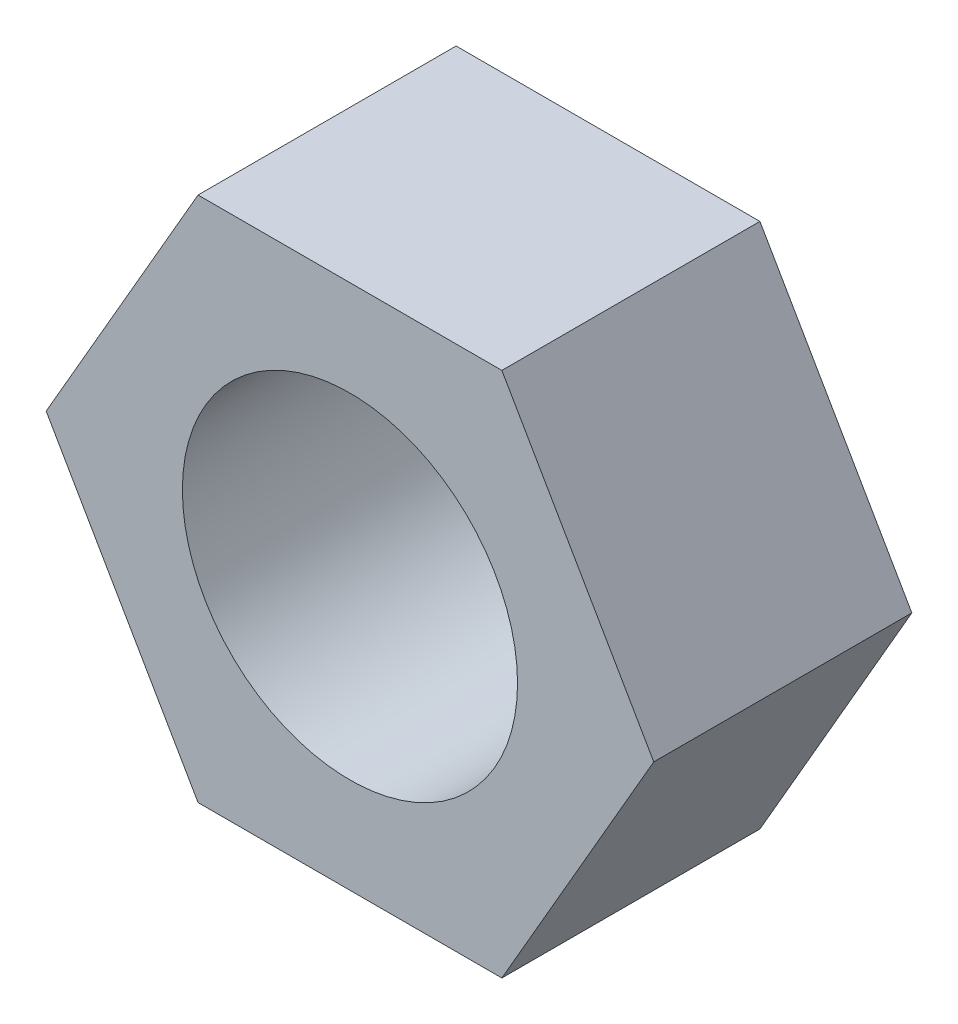
ISO-10303-21;
HEADER;
FILE_DESCRIPTION(('STEP AP214'),'2;1');
FILE_NAME('part.step','',(''),(''),'','','');
FILE_SCHEMA(('AUTOMOTIVE_DESIGN { 1 0 10303 214 1 1 1 1 }'));
ENDSEC;
DATA;
#1=APPLICATION_CONTEXT('core data for automotive mechanical design processes');
#2=APPLICATION_PROTOCOL_DEFINITION('international standard','automotive_design',2000,#1);
#3=PRODUCT_CONTEXT('',#1,'mechanical');
#4=PRODUCT('Part','Part','',(#3));
#5=PRODUCT_RELATED_PRODUCT_CATEGORY('part','',(#4));
#6=PRODUCT_DEFINITION_FORMATION('','',#4);
#7=PRODUCT_DEFINITION_CONTEXT('part definition',#1,'design');
#8=PRODUCT_DEFINITION('design','',#6,#7);
#9=PRODUCT_DEFINITION_SHAPE('','',#8);
#10=(LENGTH_UNIT() NAMED_UNIT(*) SI_UNIT(.MILLI.,.METRE.));
#11=(NAMED_UNIT(*) PLANE_ANGLE_UNIT() SI_UNIT($,.RADIAN.));
#12=(NAMED_UNIT(*) SI_UNIT($,.STERADIAN.) SOLID_ANGLE_UNIT());
#13=UNCERTAINTY_MEASURE_WITH_UNIT(LENGTH_MEASURE(1.E-05),#10,'distance_accuracy_value','');
#14=(GEOMETRIC_REPRESENTATION_CONTEXT(3) GLOBAL_UNCERTAINTY_ASSIGNED_CONTEXT((#13)) GLOBAL_UNIT_ASSIGNED_CONTEXT((#10,
#11,#12)) REPRESENTATION_CONTEXT('',''));
#15=CARTESIAN_POINT('',(0.,0.,0.));
#16=DIRECTION('',(0.,0.,1.));
#17=DIRECTION('',(1.,0.,0.));
#18=AXIS2_PLACEMENT_3D('',#15,#16,#17);
#19=CARTESIAN_POINT('',(0.,0.,3.85));
#20=DIRECTION('',(0.,0.,1.));
#21=DIRECTION('',(1.,0.,0.));
#22=AXIS2_PLACEMENT_3D('',#19,#20,#21);
#23=PLANE('',#22);
#24=DIRECTION('',(0.5,0.866025403784439,0.));
#25=VECTOR('',#24,1.);
#26=CARTESIAN_POINT('',(2.26609980656928,-3.925,3.85));
#27=LINE('',#26,#25);
#28=CARTESIAN_POINT('',(2.26609980656928,-3.925,3.85));
#29=VERTEX_POINT('',#28);
#30=CARTESIAN_POINT('',(4.53219961313856,0.,3.85));
#31=VERTEX_POINT('',#30);
#32=EDGE_CURVE('E144',#29,#31,#27,.T.);
#33=ORIENTED_EDGE('',*,*,#32,.T.);
#34=DIRECTION('',(-0.5,0.866025403784438,0.));
#35=VECTOR('',#34,1.);
#36=CARTESIAN_POINT('',(4.53219961313856,0.,3.85));
#37=LINE('',#36,#35);
#38=CARTESIAN_POINT('',(2.26609980656928,3.925,3.85));
#39=VERTEX_POINT('',#38);
#40=EDGE_CURVE('E91',#31,#39,#37,.T.);
#41=ORIENTED_EDGE('',*,*,#40,.T.);
#42=DIRECTION('',(-1.,0.,0.));
#43=VECTOR('',#42,1.);
#44=CARTESIAN_POINT('',(2.26609980656928,3.925,3.85));
#45=LINE('',#44,#43);
#46=CARTESIAN_POINT('',(-2.26609980656928,3.925,3.85));
#47=VERTEX_POINT('',#46);
#48=EDGE_CURVE('E104',#39,#47,#45,.T.);
#49=ORIENTED_EDGE('',*,*,#48,.T.);
#50=DIRECTION('',(-0.5,-0.866025403784438,0.));
#51=VECTOR('',#50,1.);
#52=CARTESIAN_POINT('',(-2.26609980656928,3.925,3.85));
#53=LINE('',#52,#51);
#54=CARTESIAN_POINT('',(-4.53219961313856,0.,3.85));
#55=VERTEX_POINT('',#54);
#56=EDGE_CURVE('E98',#47,#55,#53,.T.);
#57=ORIENTED_EDGE('',*,*,#56,.T.);
#58=DIRECTION('',(0.5,-0.866025403784439,0.));
#59=VECTOR('',#58,1.);
#60=CARTESIAN_POINT('',(-4.53219961313856,0.,3.85));
#61=LINE('',#60,#59);
#62=CARTESIAN_POINT('',(-2.26609980656928,-3.925,3.85));
#63=VERTEX_POINT('',#62);
#64=EDGE_CURVE('E102',#55,#63,#61,.T.);
#65=ORIENTED_EDGE('',*,*,#64,.T.);
#66=DIRECTION('',(1.,0.,0.));
#67=VECTOR('',#66,1.);
#68=CARTESIAN_POINT('',(-2.26609980656928,-3.925,3.85));
#69=LINE('',#68,#67);
#70=EDGE_CURVE('E54',#63,#29,#69,.T.);
#71=ORIENTED_EDGE('',*,*,#70,.T.);
#72=EDGE_LOOP('',(#33,#41,#49,#57,#65,#71));
#73=FACE_BOUND('',#72,.T.);
#74=CARTESIAN_POINT('',(0.,0.,3.85));
#75=DIRECTION('',(0.,0.,1.));
#76=DIRECTION('',(1.,0.,0.));
#77=AXIS2_PLACEMENT_3D('',#74,#75,#76);
#78=CIRCLE('',#77,2.5);
#79=CARTESIAN_POINT('',(2.5,0.,3.85));
#80=VERTEX_POINT('',#79);
#81=EDGE_CURVE('E133',#80,#80,#78,.T.);
#82=ORIENTED_EDGE('',*,*,#81,.F.);
#83=EDGE_LOOP('',(#82));
#84=FACE_BOUND('',#83,.T.);
#85=ADVANCED_FACE('F36',(#73,#84),#23,.T.);
#86=CARTESIAN_POINT('',(0.,0.,0.));
#87=DIRECTION('',(0.,0.,1.));
#88=DIRECTION('',(1.,0.,0.));
#89=AXIS2_PLACEMENT_3D('',#86,#87,#88);
#90=PLANE('',#89);
#91=DIRECTION('',(0.5,0.866025403784439,0.));
#92=VECTOR('',#91,1.);
#93=CARTESIAN_POINT('',(2.26609980656928,-3.925,0.));
#94=LINE('',#93,#92);
#95=CARTESIAN_POINT('',(2.26609980656928,-3.925,0.));
#96=VERTEX_POINT('',#95);
#97=CARTESIAN_POINT('',(4.53219961313856,0.,0.));
#98=VERTEX_POINT('',#97);
#99=EDGE_CURVE('E128',#96,#98,#94,.T.);
#100=ORIENTED_EDGE('',*,*,#99,.F.);
#101=DIRECTION('',(1.,0.,0.));
#102=VECTOR('',#101,1.);
#103=CARTESIAN_POINT('',(-2.26609980656928,-3.925,0.));
#104=LINE('',#103,#102);
#105=CARTESIAN_POINT('',(-2.26609980656928,-3.925,0.));
#106=VERTEX_POINT('',#105);
#107=EDGE_CURVE('E83',#106,#96,#104,.T.);
#108=ORIENTED_EDGE('',*,*,#107,.F.);
#109=DIRECTION('',(0.5,-0.866025403784439,0.));
#110=VECTOR('',#109,1.);
#111=CARTESIAN_POINT('',(-4.53219961313856,0.,0.));
#112=LINE('',#111,#110);
#113=CARTESIAN_POINT('',(-4.53219961313856,0.,0.));
#114=VERTEX_POINT('',#113);
#115=EDGE_CURVE('E77',#114,#106,#112,.T.);
#116=ORIENTED_EDGE('',*,*,#115,.F.);
#117=DIRECTION('',(-0.5,-0.866025403784438,0.));
#118=VECTOR('',#117,1.);
#119=CARTESIAN_POINT('',(-2.26609980656928,3.925,0.));
#120=LINE('',#119,#118);
#121=CARTESIAN_POINT('',(-2.26609980656928,3.925,0.));
#122=VERTEX_POINT('',#121);
#123=EDGE_CURVE('E113',#122,#114,#120,.T.);
#124=ORIENTED_EDGE('',*,*,#123,.F.);
#125=DIRECTION('',(-1.,0.,0.));
#126=VECTOR('',#125,1.);
#127=CARTESIAN_POINT('',(2.26609980656928,3.925,0.));
#128=LINE('',#127,#126);
#129=CARTESIAN_POINT('',(2.26609980656928,3.925,0.));
#130=VERTEX_POINT('',#129);
#131=EDGE_CURVE('E136',#130,#122,#128,.T.);
#132=ORIENTED_EDGE('',*,*,#131,.F.);
#133=DIRECTION('',(-0.5,0.866025403784438,0.));
#134=VECTOR('',#133,1.);
#135=CARTESIAN_POINT('',(4.53219961313856,0.,0.));
#136=LINE('',#135,#134);
#137=EDGE_CURVE('E132',#98,#130,#136,.T.);
#138=ORIENTED_EDGE('',*,*,#137,.F.);
#139=EDGE_LOOP('',(#100,#108,#116,#124,#132,#138));
#140=FACE_BOUND('',#139,.T.);
#141=CARTESIAN_POINT('',(0.,0.,0.));
#142=DIRECTION('',(0.,0.,1.));
#143=DIRECTION('',(1.,0.,0.));
#144=AXIS2_PLACEMENT_3D('',#141,#142,#143);
#145=CIRCLE('',#144,2.5);
#146=CARTESIAN_POINT('',(2.5,0.,0.));
#147=VERTEX_POINT('',#146);
#148=EDGE_CURVE('E249',#147,#147,#145,.T.);
#149=ORIENTED_EDGE('',*,*,#148,.T.);
#150=EDGE_LOOP('',(#149));
#151=FACE_BOUND('',#150,.T.);
#152=ADVANCED_FACE('F156',(#140,#151),#90,.F.);
#153=CARTESIAN_POINT('',(2.26609980656928,-3.925,3.85));
#154=DIRECTION('',(-0.866025403784439,0.5,0.));
#155=DIRECTION('',(-0.5,-0.866025403784439,0.));
#156=AXIS2_PLACEMENT_3D('',#153,#154,#155);
#157=PLANE('',#156);
#158=ORIENTED_EDGE('',*,*,#99,.T.);
#159=DIRECTION('',(0.,0.,-1.));
#160=VECTOR('',#159,1.);
#161=CARTESIAN_POINT('',(4.53219961313856,0.,3.85));
#162=LINE('',#161,#160);
#163=EDGE_CURVE('E11',#31,#98,#162,.T.);
#164=ORIENTED_EDGE('',*,*,#163,.F.);
#165=ORIENTED_EDGE('',*,*,#32,.F.);
#166=DIRECTION('',(0.,0.,-1.));
#167=VECTOR('',#166,1.);
#168=CARTESIAN_POINT('',(2.26609980656928,-3.925,3.85));
#169=LINE('',#168,#167);
#170=EDGE_CURVE('E124',#29,#96,#169,.T.);
#171=ORIENTED_EDGE('',*,*,#170,.T.);
#172=EDGE_LOOP('',(#158,#164,#165,#171));
#173=FACE_BOUND('',#172,.T.);
#174=ADVANCED_FACE('F38',(#173),#157,.F.);
#175=CARTESIAN_POINT('',(4.53219961313856,0.,3.85));
#176=DIRECTION('',(-0.866025403784439,-0.5,0.));
#177=DIRECTION('',(0.5,-0.866025403784439,0.));
#178=AXIS2_PLACEMENT_3D('',#175,#176,#177);
#179=PLANE('',#178);
#180=ORIENTED_EDGE('',*,*,#137,.T.);
#181=DIRECTION('',(0.,0.,-1.));
#182=VECTOR('',#181,1.);
#183=CARTESIAN_POINT('',(2.26609980656928,3.925,3.85));
#184=LINE('',#183,#182);
#185=EDGE_CURVE('E46',#39,#130,#184,.T.);
#186=ORIENTED_EDGE('',*,*,#185,.F.);
#187=ORIENTED_EDGE('',*,*,#40,.F.);
#188=ORIENTED_EDGE('',*,*,#163,.T.);
#189=EDGE_LOOP('',(#180,#186,#187,#188));
#190=FACE_BOUND('',#189,.T.);
#191=ADVANCED_FACE('F181',(#190),#179,.F.);
#192=CARTESIAN_POINT('',(2.26609980656928,3.925,3.85));
#193=DIRECTION('',(0.,-1.,0.));
#194=DIRECTION('',(1.,0.,0.));
#195=AXIS2_PLACEMENT_3D('',#192,#193,#194);
#196=PLANE('',#195);
#197=ORIENTED_EDGE('',*,*,#131,.T.);
#198=DIRECTION('',(0.,0.,-1.));
#199=VECTOR('',#198,1.);
#200=CARTESIAN_POINT('',(-2.26609980656928,3.925,3.85));
#201=LINE('',#200,#199);
#202=EDGE_CURVE('E115',#47,#122,#201,.T.);
#203=ORIENTED_EDGE('',*,*,#202,.F.);
#204=ORIENTED_EDGE('',*,*,#48,.F.);
#205=ORIENTED_EDGE('',*,*,#185,.T.);
#206=EDGE_LOOP('',(#197,#203,#204,#205));
#207=FACE_BOUND('',#206,.T.);
#208=ADVANCED_FACE('F153',(#207),#196,.F.);
#209=CARTESIAN_POINT('',(-2.26609980656928,3.925,3.85));
#210=DIRECTION('',(0.866025403784439,-0.5,0.));
#211=DIRECTION('',(0.5,0.866025403784439,0.));
#212=AXIS2_PLACEMENT_3D('',#209,#210,#211);
#213=PLANE('',#212);
#214=ORIENTED_EDGE('',*,*,#123,.T.);
#215=DIRECTION('',(0.,0.,-1.));
#216=VECTOR('',#215,1.);
#217=CARTESIAN_POINT('',(-4.53219961313856,0.,3.85));
#218=LINE('',#217,#216);
#219=EDGE_CURVE('E110',#55,#114,#218,.T.);
#220=ORIENTED_EDGE('',*,*,#219,.F.);
#221=ORIENTED_EDGE('',*,*,#56,.F.);
#222=ORIENTED_EDGE('',*,*,#202,.T.);
#223=EDGE_LOOP('',(#214,#220,#221,#222));
#224=FACE_BOUND('',#223,.T.);
#225=ADVANCED_FACE('F111',(#224),#213,.F.);
#226=CARTESIAN_POINT('',(-4.53219961313856,0.,3.85));
#227=DIRECTION('',(0.866025403784439,0.5,0.));
#228=DIRECTION('',(-0.5,0.866025403784439,0.));
#229=AXIS2_PLACEMENT_3D('',#226,#227,#228);
#230=PLANE('',#229);
#231=ORIENTED_EDGE('',*,*,#115,.T.);
#232=DIRECTION('',(0.,0.,-1.));
#233=VECTOR('',#232,1.);
#234=CARTESIAN_POINT('',(-2.26609980656928,-3.925,3.85));
#235=LINE('',#234,#233);
#236=EDGE_CURVE('E116',#63,#106,#235,.T.);
#237=ORIENTED_EDGE('',*,*,#236,.F.);
#238=ORIENTED_EDGE('',*,*,#64,.F.);
#239=ORIENTED_EDGE('',*,*,#219,.T.);
#240=EDGE_LOOP('',(#231,#237,#238,#239));
#241=FACE_BOUND('',#240,.T.);
#242=ADVANCED_FACE('F118',(#241),#230,.F.);
#243=CARTESIAN_POINT('',(-2.26609980656928,-3.925,3.85));
#244=DIRECTION('',(0.,1.,0.));
#245=DIRECTION('',(-1.,0.,0.));
#246=AXIS2_PLACEMENT_3D('',#243,#244,#245);
#247=PLANE('',#246);
#248=ORIENTED_EDGE('',*,*,#107,.T.);
#249=ORIENTED_EDGE('',*,*,#170,.F.);
#250=ORIENTED_EDGE('',*,*,#70,.F.);
#251=ORIENTED_EDGE('',*,*,#236,.T.);
#252=EDGE_LOOP('',(#248,#249,#250,#251));
#253=FACE_BOUND('',#252,.T.);
#254=ADVANCED_FACE('F161',(#253),#247,.F.);
#255=CARTESIAN_POINT('',(0.,0.,3.85));
#256=DIRECTION('',(0.,0.,-1.));
#257=DIRECTION('',(-1.,0.,0.));
#258=AXIS2_PLACEMENT_3D('',#255,#256,#257);
#259=CYLINDRICAL_SURFACE('',#258,2.5);
#260=ORIENTED_EDGE('',*,*,#81,.T.);
#261=EDGE_LOOP('',(#260));
#262=FACE_BOUND('',#261,.T.);
#263=ORIENTED_EDGE('',*,*,#148,.F.);
#264=EDGE_LOOP('',(#263));
#265=FACE_BOUND('',#264,.T.);
#266=ADVANCED_FACE('F163',(#262,#265),#259,.F.);
#267=CLOSED_SHELL('',(#85,#152,#174,#191,#208,#225,#242,#254,#266));
#268=MANIFOLD_SOLID_BREP('B2',#267);
#269=ADVANCED_BREP_SHAPE_REPRESENTATION('',(#18,#268),#14);
#270=SHAPE_DEFINITION_REPRESENTATION(#9,#269);
ENDSEC;
END-ISO-10303-21;
